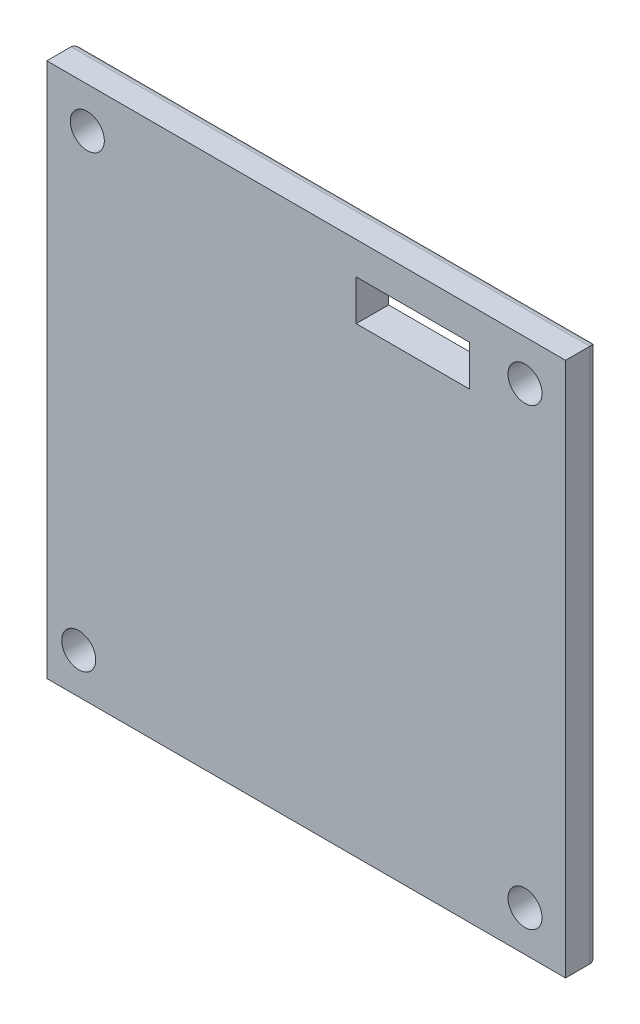
ISO-10303-21;
HEADER;
FILE_DESCRIPTION(('STEP AP214'),'2;1');
FILE_NAME('part.step','',(''),(''),'','','');
FILE_SCHEMA(('AUTOMOTIVE_DESIGN { 1 0 10303 214 1 1 1 1 }'));
ENDSEC;
DATA;
#1=APPLICATION_CONTEXT('core data for automotive mechanical design processes');
#2=APPLICATION_PROTOCOL_DEFINITION('international standard','automotive_design',2000,#1);
#3=PRODUCT_CONTEXT('',#1,'mechanical');
#4=PRODUCT('Part','Part','',(#3));
#5=PRODUCT_RELATED_PRODUCT_CATEGORY('part','',(#4));
#6=PRODUCT_DEFINITION_FORMATION('','',#4);
#7=PRODUCT_DEFINITION_CONTEXT('part definition',#1,'design');
#8=PRODUCT_DEFINITION('design','',#6,#7);
#9=PRODUCT_DEFINITION_SHAPE('','',#8);
#10=(LENGTH_UNIT() NAMED_UNIT(*) SI_UNIT(.MILLI.,.METRE.));
#11=(NAMED_UNIT(*) PLANE_ANGLE_UNIT() SI_UNIT($,.RADIAN.));
#12=(NAMED_UNIT(*) SI_UNIT($,.STERADIAN.) SOLID_ANGLE_UNIT());
#13=UNCERTAINTY_MEASURE_WITH_UNIT(LENGTH_MEASURE(1.E-05),#10,'distance_accuracy_value','');
#14=(GEOMETRIC_REPRESENTATION_CONTEXT(3) GLOBAL_UNCERTAINTY_ASSIGNED_CONTEXT((#13)) GLOBAL_UNIT_ASSIGNED_CONTEXT((#10,
#11,#12)) REPRESENTATION_CONTEXT('',''));
#15=CARTESIAN_POINT('',(0.,0.,0.));
#16=DIRECTION('',(0.,0.,1.));
#17=DIRECTION('',(1.,0.,0.));
#18=AXIS2_PLACEMENT_3D('',#15,#16,#17);
#19=CARTESIAN_POINT('',(0.,0.,-4.));
#20=DIRECTION('',(0.,0.,-1.));
#21=DIRECTION('',(-1.,0.,0.));
#22=AXIS2_PLACEMENT_3D('',#19,#20,#21);
#23=PLANE('',#22);
#24=CARTESIAN_POINT('',(0.,0.,-4.));
#25=DIRECTION('',(0.,0.,-1.));
#26=DIRECTION('',(-1.,0.,0.));
#27=AXIS2_PLACEMENT_3D('',#24,#25,#26);
#28=CIRCLE('',#27,4.);
#29=CARTESIAN_POINT('',(-4.,0.,-4.));
#30=VERTEX_POINT('',#29);
#31=EDGE_CURVE('E266',#30,#30,#28,.T.);
#32=ORIENTED_EDGE('',*,*,#31,.F.);
#33=EDGE_LOOP('',(#32));
#34=FACE_BOUND('',#33,.T.);
#35=CARTESIAN_POINT('',(-27.,28.,-4.));
#36=DIRECTION('',(0.,0.,-1.));
#37=DIRECTION('',(-1.,0.,0.));
#38=AXIS2_PLACEMENT_3D('',#35,#36,#37);
#39=CIRCLE('',#38,2.1);
#40=CARTESIAN_POINT('',(-29.1,28.,-4.));
#41=VERTEX_POINT('',#40);
#42=EDGE_CURVE('E254',#41,#41,#39,.T.);
#43=ORIENTED_EDGE('',*,*,#42,.F.);
#44=EDGE_LOOP('',(#43));
#45=FACE_BOUND('',#44,.T.);
#46=CARTESIAN_POINT('',(-28.0566288963371,-28.,-4.));
#47=DIRECTION('',(0.,0.,-1.));
#48=DIRECTION('',(-1.,0.,0.));
#49=AXIS2_PLACEMENT_3D('',#46,#47,#48);
#50=CIRCLE('',#49,2.1);
#51=CARTESIAN_POINT('',(-30.1566288963371,-28.,-4.));
#52=VERTEX_POINT('',#51);
#53=EDGE_CURVE('E258',#52,#52,#50,.T.);
#54=ORIENTED_EDGE('',*,*,#53,.F.);
#55=EDGE_LOOP('',(#54));
#56=FACE_BOUND('',#55,.T.);
#57=CARTESIAN_POINT('',(27.,-28.,-4.));
#58=DIRECTION('',(0.,0.,-1.));
#59=DIRECTION('',(-1.,0.,0.));
#60=AXIS2_PLACEMENT_3D('',#57,#58,#59);
#61=CIRCLE('',#60,2.1);
#62=CARTESIAN_POINT('',(24.9,-28.,-4.));
#63=VERTEX_POINT('',#62);
#64=EDGE_CURVE('E253',#63,#63,#61,.T.);
#65=ORIENTED_EDGE('',*,*,#64,.F.);
#66=EDGE_LOOP('',(#65));
#67=FACE_BOUND('',#66,.T.);
#68=CARTESIAN_POINT('',(27.,28.,-4.));
#69=DIRECTION('',(0.,0.,-1.));
#70=DIRECTION('',(-1.,0.,0.));
#71=AXIS2_PLACEMENT_3D('',#68,#69,#70);
#72=CIRCLE('',#71,2.1);
#73=CARTESIAN_POINT('',(24.9,28.,-4.));
#74=VERTEX_POINT('',#73);
#75=EDGE_CURVE('E236',#74,#74,#72,.T.);
#76=ORIENTED_EDGE('',*,*,#75,.F.);
#77=EDGE_LOOP('',(#76));
#78=FACE_BOUND('',#77,.T.);
#79=DIRECTION('',(0.,1.,0.));
#80=VECTOR('',#79,1.);
#81=CARTESIAN_POINT('',(6.17094740106361,29.,-4.));
#82=LINE('',#81,#80);
#83=CARTESIAN_POINT('',(6.17094740106361,24.,-4.));
#84=VERTEX_POINT('',#83);
#85=CARTESIAN_POINT('',(6.17094740106361,29.,-4.));
#86=VERTEX_POINT('',#85);
#87=EDGE_CURVE('E67',#84,#86,#82,.T.);
#88=ORIENTED_EDGE('',*,*,#87,.F.);
#89=DIRECTION('',(-1.,0.,0.));
#90=VECTOR('',#89,1.);
#91=CARTESIAN_POINT('',(20.1709474010636,24.,-4.));
#92=LINE('',#91,#90);
#93=CARTESIAN_POINT('',(20.1709474010636,24.,-4.));
#94=VERTEX_POINT('',#93);
#95=EDGE_CURVE('E140',#94,#84,#92,.T.);
#96=ORIENTED_EDGE('',*,*,#95,.F.);
#97=DIRECTION('',(0.,-1.,0.));
#98=VECTOR('',#97,1.);
#99=CARTESIAN_POINT('',(20.1709474010636,29.,-4.));
#100=LINE('',#99,#98);
#101=CARTESIAN_POINT('',(20.1709474010636,29.,-4.));
#102=VERTEX_POINT('',#101);
#103=EDGE_CURVE('E123',#102,#94,#100,.T.);
#104=ORIENTED_EDGE('',*,*,#103,.F.);
#105=DIRECTION('',(1.,0.,0.));
#106=VECTOR('',#105,1.);
#107=CARTESIAN_POINT('',(20.1709474010636,29.,-4.));
#108=LINE('',#107,#106);
#109=EDGE_CURVE('E133',#86,#102,#108,.T.);
#110=ORIENTED_EDGE('',*,*,#109,.F.);
#111=EDGE_LOOP('',(#88,#96,#104,#110));
#112=FACE_BOUND('',#111,.T.);
#113=DIRECTION('',(-1.,0.,0.));
#114=VECTOR('',#113,1.);
#115=CARTESIAN_POINT('',(-32.,-32.,-4.));
#116=LINE('',#115,#114);
#117=CARTESIAN_POINT('',(31.,-32.,-4.));
#118=VERTEX_POINT('',#117);
#119=CARTESIAN_POINT('',(-31.,-32.,-4.));
#120=VERTEX_POINT('',#119);
#121=EDGE_CURVE('E197',#118,#120,#116,.T.);
#122=ORIENTED_EDGE('',*,*,#121,.T.);
#123=DIRECTION('',(0.,1.,0.));
#124=VECTOR('',#123,1.);
#125=CARTESIAN_POINT('',(-31.,33.,-4.));
#126=LINE('',#125,#124);
#127=CARTESIAN_POINT('',(-31.,32.,-4.));
#128=VERTEX_POINT('',#127);
#129=EDGE_CURVE('E206',#120,#128,#126,.T.);
#130=ORIENTED_EDGE('',*,*,#129,.T.);
#131=DIRECTION('',(1.,0.,0.));
#132=VECTOR('',#131,1.);
#133=CARTESIAN_POINT('',(32.,32.,-4.));
#134=LINE('',#133,#132);
#135=CARTESIAN_POINT('',(31.,32.,-4.));
#136=VERTEX_POINT('',#135);
#137=EDGE_CURVE('E203',#128,#136,#134,.T.);
#138=ORIENTED_EDGE('',*,*,#137,.T.);
#139=DIRECTION('',(0.,-1.,0.));
#140=VECTOR('',#139,1.);
#141=CARTESIAN_POINT('',(31.,-33.,-4.));
#142=LINE('',#141,#140);
#143=EDGE_CURVE('E200',#136,#118,#142,.T.);
#144=ORIENTED_EDGE('',*,*,#143,.T.);
#145=EDGE_LOOP('',(#122,#130,#138,#144));
#146=FACE_BOUND('',#145,.T.);
#147=ADVANCED_FACE('F41',(#34,#45,#56,#67,#78,#112,#146),#23,.T.);
#148=CARTESIAN_POINT('',(32.,-33.,-4.));
#149=DIRECTION('',(0.,1.,0.));
#150=DIRECTION('',(0.,0.,1.));
#151=AXIS2_PLACEMENT_3D('',#148,#149,#150);
#152=PLANE('',#151);
#153=DIRECTION('',(0.,0.,1.));
#154=VECTOR('',#153,1.);
#155=CARTESIAN_POINT('',(-32.,-33.,-4.));
#156=LINE('',#155,#154);
#157=CARTESIAN_POINT('',(-32.,-33.,-3.));
#158=VERTEX_POINT('',#157);
#159=CARTESIAN_POINT('',(-32.,-33.,0.));
#160=VERTEX_POINT('',#159);
#161=EDGE_CURVE('E185',#158,#160,#156,.T.);
#162=ORIENTED_EDGE('',*,*,#161,.F.);
#163=DIRECTION('',(-1.,0.,0.));
#164=VECTOR('',#163,1.);
#165=CARTESIAN_POINT('',(32.,-33.,-3.));
#166=LINE('',#165,#164);
#167=CARTESIAN_POINT('',(32.,-33.,-3.));
#168=VERTEX_POINT('',#167);
#169=EDGE_CURVE('E11',#158,#168,#166,.F.);
#170=ORIENTED_EDGE('',*,*,#169,.T.);
#171=DIRECTION('',(0.,0.,1.));
#172=VECTOR('',#171,1.);
#173=CARTESIAN_POINT('',(32.,-33.,-4.));
#174=LINE('',#173,#172);
#175=CARTESIAN_POINT('',(32.,-33.,0.));
#176=VERTEX_POINT('',#175);
#177=EDGE_CURVE('E188',#168,#176,#174,.T.);
#178=ORIENTED_EDGE('',*,*,#177,.T.);
#179=DIRECTION('',(-1.,0.,0.));
#180=VECTOR('',#179,1.);
#181=CARTESIAN_POINT('',(32.,-33.,0.));
#182=LINE('',#181,#180);
#183=EDGE_CURVE('E181',#176,#160,#182,.T.);
#184=ORIENTED_EDGE('',*,*,#183,.T.);
#185=EDGE_LOOP('',(#162,#170,#178,#184));
#186=FACE_BOUND('',#185,.T.);
#187=ADVANCED_FACE('F285',(#186),#152,.F.);
#188=CARTESIAN_POINT('',(32.,33.,-4.));
#189=DIRECTION('',(-1.,0.,0.));
#190=DIRECTION('',(0.,-1.,0.));
#191=AXIS2_PLACEMENT_3D('',#188,#189,#190);
#192=PLANE('',#191);
#193=ORIENTED_EDGE('',*,*,#177,.F.);
#194=DIRECTION('',(0.,-1.,0.));
#195=VECTOR('',#194,1.);
#196=CARTESIAN_POINT('',(32.,33.,-3.));
#197=LINE('',#196,#195);
#198=CARTESIAN_POINT('',(32.,33.,-3.));
#199=VERTEX_POINT('',#198);
#200=EDGE_CURVE('E51',#168,#199,#197,.F.);
#201=ORIENTED_EDGE('',*,*,#200,.T.);
#202=DIRECTION('',(0.,0.,1.));
#203=VECTOR('',#202,1.);
#204=CARTESIAN_POINT('',(32.,33.,-4.));
#205=LINE('',#204,#203);
#206=CARTESIAN_POINT('',(32.,33.,0.));
#207=VERTEX_POINT('',#206);
#208=EDGE_CURVE('E191',#199,#207,#205,.T.);
#209=ORIENTED_EDGE('',*,*,#208,.T.);
#210=DIRECTION('',(0.,-1.,0.));
#211=VECTOR('',#210,1.);
#212=CARTESIAN_POINT('',(32.,33.,0.));
#213=LINE('',#212,#211);
#214=EDGE_CURVE('E177',#207,#176,#213,.T.);
#215=ORIENTED_EDGE('',*,*,#214,.T.);
#216=EDGE_LOOP('',(#193,#201,#209,#215));
#217=FACE_BOUND('',#216,.T.);
#218=ADVANCED_FACE('F321',(#217),#192,.F.);
#219=CARTESIAN_POINT('',(32.,33.,-4.));
#220=DIRECTION('',(0.,-1.,0.));
#221=DIRECTION('',(0.,0.,-1.));
#222=AXIS2_PLACEMENT_3D('',#219,#220,#221);
#223=PLANE('',#222);
#224=ORIENTED_EDGE('',*,*,#208,.F.);
#225=DIRECTION('',(1.,0.,0.));
#226=VECTOR('',#225,1.);
#227=CARTESIAN_POINT('',(-32.,33.,-3.));
#228=LINE('',#227,#226);
#229=CARTESIAN_POINT('',(-32.,33.,-3.));
#230=VERTEX_POINT('',#229);
#231=EDGE_CURVE('E214',#199,#230,#228,.F.);
#232=ORIENTED_EDGE('',*,*,#231,.T.);
#233=DIRECTION('',(0.,0.,1.));
#234=VECTOR('',#233,1.);
#235=CARTESIAN_POINT('',(-32.,33.,-4.));
#236=LINE('',#235,#234);
#237=CARTESIAN_POINT('',(-32.,33.,0.));
#238=VERTEX_POINT('',#237);
#239=EDGE_CURVE('E194',#230,#238,#236,.T.);
#240=ORIENTED_EDGE('',*,*,#239,.T.);
#241=DIRECTION('',(1.,0.,0.));
#242=VECTOR('',#241,1.);
#243=CARTESIAN_POINT('',(32.,33.,0.));
#244=LINE('',#243,#242);
#245=EDGE_CURVE('E172',#238,#207,#244,.T.);
#246=ORIENTED_EDGE('',*,*,#245,.T.);
#247=EDGE_LOOP('',(#224,#232,#240,#246));
#248=FACE_BOUND('',#247,.T.);
#249=ADVANCED_FACE('F325',(#248),#223,.F.);
#250=CARTESIAN_POINT('',(-32.,33.,-4.));
#251=DIRECTION('',(1.,0.,0.));
#252=DIRECTION('',(0.,1.,0.));
#253=AXIS2_PLACEMENT_3D('',#250,#251,#252);
#254=PLANE('',#253);
#255=ORIENTED_EDGE('',*,*,#239,.F.);
#256=DIRECTION('',(0.,1.,0.));
#257=VECTOR('',#256,1.);
#258=CARTESIAN_POINT('',(-32.,-33.,-3.));
#259=LINE('',#258,#257);
#260=EDGE_CURVE('E210',#230,#158,#259,.F.);
#261=ORIENTED_EDGE('',*,*,#260,.T.);
#262=ORIENTED_EDGE('',*,*,#161,.T.);
#263=DIRECTION('',(0.,1.,0.));
#264=VECTOR('',#263,1.);
#265=CARTESIAN_POINT('',(-32.,33.,0.));
#266=LINE('',#265,#264);
#267=EDGE_CURVE('E168',#160,#238,#266,.T.);
#268=ORIENTED_EDGE('',*,*,#267,.T.);
#269=EDGE_LOOP('',(#255,#261,#262,#268));
#270=FACE_BOUND('',#269,.T.);
#271=ADVANCED_FACE('F313',(#270),#254,.F.);
#272=CARTESIAN_POINT('',(31.,0.,-3.));
#273=DIRECTION('',(0.,1.,0.));
#274=DIRECTION('',(-1.,0.,0.));
#275=AXIS2_PLACEMENT_3D('',#272,#273,#274);
#276=CYLINDRICAL_SURFACE('',#275,1.);
#277=CARTESIAN_POINT('',(31.,32.,-3.));
#278=DIRECTION('',(-0.707106781186547,0.707106781186548,0.));
#279=DIRECTION('',(0.707106781186547,0.707106781186547,0.));
#280=AXIS2_PLACEMENT_3D('',#277,#278,#279);
#281=ELLIPSE('',#280,1.4142135623731,1.);
#282=EDGE_CURVE('E224',#199,#136,#281,.T.);
#283=ORIENTED_EDGE('',*,*,#282,.F.);
#284=ORIENTED_EDGE('',*,*,#200,.F.);
#285=CARTESIAN_POINT('',(31.,-32.,-3.));
#286=DIRECTION('',(0.707106781186547,0.707106781186547,0.));
#287=DIRECTION('',(0.707106781186547,-0.707106781186548,0.));
#288=AXIS2_PLACEMENT_3D('',#285,#286,#287);
#289=ELLIPSE('',#288,1.41421356237309,1.);
#290=EDGE_CURVE('E173',#118,#168,#289,.F.);
#291=ORIENTED_EDGE('',*,*,#290,.F.);
#292=ORIENTED_EDGE('',*,*,#143,.F.);
#293=EDGE_LOOP('',(#283,#284,#291,#292));
#294=FACE_BOUND('',#293,.T.);
#295=ADVANCED_FACE('F43',(#294),#276,.T.);
#296=CARTESIAN_POINT('',(0.,-32.,-3.));
#297=DIRECTION('',(1.,0.,0.));
#298=DIRECTION('',(0.,0.,-1.));
#299=AXIS2_PLACEMENT_3D('',#296,#297,#298);
#300=CYLINDRICAL_SURFACE('',#299,1.);
#301=ORIENTED_EDGE('',*,*,#290,.T.);
#302=ORIENTED_EDGE('',*,*,#169,.F.);
#303=CARTESIAN_POINT('',(-31.,-32.,-3.));
#304=DIRECTION('',(0.707106781186547,-0.707106781186548,0.));
#305=DIRECTION('',(0.707106781186548,0.707106781186547,0.));
#306=AXIS2_PLACEMENT_3D('',#303,#304,#305);
#307=ELLIPSE('',#306,1.4142135623731,1.);
#308=EDGE_CURVE('E221',#120,#158,#307,.F.);
#309=ORIENTED_EDGE('',*,*,#308,.F.);
#310=ORIENTED_EDGE('',*,*,#121,.F.);
#311=EDGE_LOOP('',(#301,#302,#309,#310));
#312=FACE_BOUND('',#311,.T.);
#313=ADVANCED_FACE('F337',(#312),#300,.T.);
#314=CARTESIAN_POINT('',(0.,32.,-3.));
#315=DIRECTION('',(-1.,0.,0.));
#316=DIRECTION('',(0.,0.,1.));
#317=AXIS2_PLACEMENT_3D('',#314,#315,#316);
#318=CYLINDRICAL_SURFACE('',#317,1.);
#319=ORIENTED_EDGE('',*,*,#282,.T.);
#320=ORIENTED_EDGE('',*,*,#137,.F.);
#321=CARTESIAN_POINT('',(-31.,32.,-3.));
#322=DIRECTION('',(-0.707106781186548,-0.707106781186547,0.));
#323=DIRECTION('',(-0.707106781186547,0.707106781186548,0.));
#324=AXIS2_PLACEMENT_3D('',#321,#322,#323);
#325=ELLIPSE('',#324,1.41421356237309,1.);
#326=EDGE_CURVE('E167',#230,#128,#325,.T.);
#327=ORIENTED_EDGE('',*,*,#326,.F.);
#328=ORIENTED_EDGE('',*,*,#231,.F.);
#329=EDGE_LOOP('',(#319,#320,#327,#328));
#330=FACE_BOUND('',#329,.T.);
#331=ADVANCED_FACE('F329',(#330),#318,.T.);
#332=CARTESIAN_POINT('',(-31.,0.,-3.));
#333=DIRECTION('',(0.,-1.,0.));
#334=DIRECTION('',(1.,0.,0.));
#335=AXIS2_PLACEMENT_3D('',#332,#333,#334);
#336=CYLINDRICAL_SURFACE('',#335,1.);
#337=ORIENTED_EDGE('',*,*,#308,.T.);
#338=ORIENTED_EDGE('',*,*,#260,.F.);
#339=ORIENTED_EDGE('',*,*,#326,.T.);
#340=ORIENTED_EDGE('',*,*,#129,.F.);
#341=EDGE_LOOP('',(#337,#338,#339,#340));
#342=FACE_BOUND('',#341,.T.);
#343=ADVANCED_FACE('F333',(#342),#336,.T.);
#344=CARTESIAN_POINT('',(6.17094740106361,29.,18.));
#345=DIRECTION('',(-1.,0.,0.));
#346=DIRECTION('',(0.,0.,1.));
#347=AXIS2_PLACEMENT_3D('',#344,#345,#346);
#348=PLANE('',#347);
#349=DIRECTION('',(0.,0.,-1.));
#350=VECTOR('',#349,1.);
#351=CARTESIAN_POINT('',(6.17094740106361,24.,18.));
#352=LINE('',#351,#350);
#353=CARTESIAN_POINT('',(6.17094740106361,24.,0.));
#354=VERTEX_POINT('',#353);
#355=EDGE_CURVE('E147',#354,#84,#352,.T.);
#356=ORIENTED_EDGE('',*,*,#355,.T.);
#357=ORIENTED_EDGE('',*,*,#87,.T.);
#358=DIRECTION('',(0.,0.,-1.));
#359=VECTOR('',#358,1.);
#360=CARTESIAN_POINT('',(6.17094740106361,29.,18.));
#361=LINE('',#360,#359);
#362=CARTESIAN_POINT('',(6.17094740106361,29.,0.));
#363=VERTEX_POINT('',#362);
#364=EDGE_CURVE('E130',#363,#86,#361,.T.);
#365=ORIENTED_EDGE('',*,*,#364,.F.);
#366=DIRECTION('',(0.,1.,0.));
#367=VECTOR('',#366,1.);
#368=CARTESIAN_POINT('',(6.17094740106361,0.,0.));
#369=LINE('',#368,#367);
#370=EDGE_CURVE('E163',#354,#363,#369,.T.);
#371=ORIENTED_EDGE('',*,*,#370,.F.);
#372=EDGE_LOOP('',(#356,#357,#365,#371));
#373=FACE_BOUND('',#372,.T.);
#374=ADVANCED_FACE('F355',(#373),#348,.F.);
#375=CARTESIAN_POINT('',(20.1709474010636,24.,18.));
#376=DIRECTION('',(0.,-1.,0.));
#377=DIRECTION('',(1.,0.,0.));
#378=AXIS2_PLACEMENT_3D('',#375,#376,#377);
#379=PLANE('',#378);
#380=DIRECTION('',(0.,0.,-1.));
#381=VECTOR('',#380,1.);
#382=CARTESIAN_POINT('',(20.1709474010636,24.,18.));
#383=LINE('',#382,#381);
#384=CARTESIAN_POINT('',(20.1709474010636,24.,0.));
#385=VERTEX_POINT('',#384);
#386=EDGE_CURVE('E129',#385,#94,#383,.T.);
#387=ORIENTED_EDGE('',*,*,#386,.T.);
#388=ORIENTED_EDGE('',*,*,#95,.T.);
#389=ORIENTED_EDGE('',*,*,#355,.F.);
#390=DIRECTION('',(-1.,0.,0.));
#391=VECTOR('',#390,1.);
#392=CARTESIAN_POINT('',(0.,24.,0.));
#393=LINE('',#392,#391);
#394=EDGE_CURVE('E159',#385,#354,#393,.T.);
#395=ORIENTED_EDGE('',*,*,#394,.F.);
#396=EDGE_LOOP('',(#387,#388,#389,#395));
#397=FACE_BOUND('',#396,.T.);
#398=ADVANCED_FACE('F371',(#397),#379,.F.);
#399=CARTESIAN_POINT('',(20.1709474010636,29.,18.));
#400=DIRECTION('',(1.,0.,0.));
#401=DIRECTION('',(0.,0.,-1.));
#402=AXIS2_PLACEMENT_3D('',#399,#400,#401);
#403=PLANE('',#402);
#404=DIRECTION('',(0.,0.,-1.));
#405=VECTOR('',#404,1.);
#406=CARTESIAN_POINT('',(20.1709474010636,29.,18.));
#407=LINE('',#406,#405);
#408=CARTESIAN_POINT('',(20.1709474010636,29.,0.));
#409=VERTEX_POINT('',#408);
#410=EDGE_CURVE('E59',#409,#102,#407,.T.);
#411=ORIENTED_EDGE('',*,*,#410,.T.);
#412=ORIENTED_EDGE('',*,*,#103,.T.);
#413=ORIENTED_EDGE('',*,*,#386,.F.);
#414=DIRECTION('',(0.,-1.,0.));
#415=VECTOR('',#414,1.);
#416=CARTESIAN_POINT('',(20.1709474010636,0.,0.));
#417=LINE('',#416,#415);
#418=EDGE_CURVE('E126',#409,#385,#417,.T.);
#419=ORIENTED_EDGE('',*,*,#418,.F.);
#420=EDGE_LOOP('',(#411,#412,#413,#419));
#421=FACE_BOUND('',#420,.T.);
#422=ADVANCED_FACE('F120',(#421),#403,.F.);
#423=CARTESIAN_POINT('',(20.1709474010636,29.,18.));
#424=DIRECTION('',(0.,1.,0.));
#425=DIRECTION('',(0.,0.,1.));
#426=AXIS2_PLACEMENT_3D('',#423,#424,#425);
#427=PLANE('',#426);
#428=ORIENTED_EDGE('',*,*,#364,.T.);
#429=ORIENTED_EDGE('',*,*,#109,.T.);
#430=ORIENTED_EDGE('',*,*,#410,.F.);
#431=DIRECTION('',(1.,0.,0.));
#432=VECTOR('',#431,1.);
#433=CARTESIAN_POINT('',(0.,29.,0.));
#434=LINE('',#433,#432);
#435=EDGE_CURVE('E150',#363,#409,#434,.T.);
#436=ORIENTED_EDGE('',*,*,#435,.F.);
#437=EDGE_LOOP('',(#428,#429,#430,#436));
#438=FACE_BOUND('',#437,.T.);
#439=ADVANCED_FACE('F134',(#438),#427,.F.);
#440=CARTESIAN_POINT('',(0.,0.,0.));
#441=DIRECTION('',(0.,0.,-1.));
#442=DIRECTION('',(-1.,0.,0.));
#443=AXIS2_PLACEMENT_3D('',#440,#441,#442);
#444=PLANE('',#443);
#445=CARTESIAN_POINT('',(-27.,28.,0.));
#446=DIRECTION('',(0.,0.,-1.));
#447=DIRECTION('',(-1.,0.,0.));
#448=AXIS2_PLACEMENT_3D('',#445,#446,#447);
#449=CIRCLE('',#448,2.1);
#450=CARTESIAN_POINT('',(-29.1,28.,0.));
#451=VERTEX_POINT('',#450);
#452=EDGE_CURVE('E45',#451,#451,#449,.T.);
#453=ORIENTED_EDGE('',*,*,#452,.T.);
#454=EDGE_LOOP('',(#453));
#455=FACE_BOUND('',#454,.T.);
#456=CARTESIAN_POINT('',(-28.0566288963371,-28.,0.));
#457=DIRECTION('',(0.,0.,-1.));
#458=DIRECTION('',(-1.,0.,0.));
#459=AXIS2_PLACEMENT_3D('',#456,#457,#458);
#460=CIRCLE('',#459,2.1);
#461=CARTESIAN_POINT('',(-30.1566288963371,-28.,0.));
#462=VERTEX_POINT('',#461);
#463=EDGE_CURVE('E239',#462,#462,#460,.T.);
#464=ORIENTED_EDGE('',*,*,#463,.T.);
#465=EDGE_LOOP('',(#464));
#466=FACE_BOUND('',#465,.T.);
#467=CARTESIAN_POINT('',(27.,-28.,0.));
#468=DIRECTION('',(0.,0.,-1.));
#469=DIRECTION('',(-1.,0.,0.));
#470=AXIS2_PLACEMENT_3D('',#467,#468,#469);
#471=CIRCLE('',#470,2.1);
#472=CARTESIAN_POINT('',(24.9,-28.,0.));
#473=VERTEX_POINT('',#472);
#474=EDGE_CURVE('E235',#473,#473,#471,.T.);
#475=ORIENTED_EDGE('',*,*,#474,.T.);
#476=EDGE_LOOP('',(#475));
#477=FACE_BOUND('',#476,.T.);
#478=CARTESIAN_POINT('',(27.,28.,0.));
#479=DIRECTION('',(0.,0.,-1.));
#480=DIRECTION('',(-1.,0.,0.));
#481=AXIS2_PLACEMENT_3D('',#478,#479,#480);
#482=CIRCLE('',#481,2.1);
#483=CARTESIAN_POINT('',(24.9,28.,0.));
#484=VERTEX_POINT('',#483);
#485=EDGE_CURVE('E231',#484,#484,#482,.T.);
#486=ORIENTED_EDGE('',*,*,#485,.T.);
#487=EDGE_LOOP('',(#486));
#488=FACE_BOUND('',#487,.T.);
#489=ORIENTED_EDGE('',*,*,#394,.T.);
#490=ORIENTED_EDGE('',*,*,#370,.T.);
#491=ORIENTED_EDGE('',*,*,#435,.T.);
#492=ORIENTED_EDGE('',*,*,#418,.T.);
#493=EDGE_LOOP('',(#489,#490,#491,#492));
#494=FACE_BOUND('',#493,.T.);
#495=ORIENTED_EDGE('',*,*,#267,.F.);
#496=ORIENTED_EDGE('',*,*,#183,.F.);
#497=ORIENTED_EDGE('',*,*,#214,.F.);
#498=ORIENTED_EDGE('',*,*,#245,.F.);
#499=EDGE_LOOP('',(#495,#496,#497,#498));
#500=FACE_BOUND('',#499,.T.);
#501=ADVANCED_FACE('F299',(#455,#466,#477,#488,#494,#500),#444,.F.);
#502=CARTESIAN_POINT('',(27.,28.,8.));
#503=DIRECTION('',(0.,0.,-1.));
#504=DIRECTION('',(-1.,0.,0.));
#505=AXIS2_PLACEMENT_3D('',#502,#503,#504);
#506=CYLINDRICAL_SURFACE('',#505,2.1);
#507=ORIENTED_EDGE('',*,*,#75,.T.);
#508=EDGE_LOOP('',(#507));
#509=FACE_BOUND('',#508,.T.);
#510=ORIENTED_EDGE('',*,*,#485,.F.);
#511=EDGE_LOOP('',(#510));
#512=FACE_BOUND('',#511,.T.);
#513=ADVANCED_FACE('F295',(#509,#512),#506,.F.);
#514=CARTESIAN_POINT('',(27.,-28.,8.));
#515=DIRECTION('',(0.,0.,-1.));
#516=DIRECTION('',(-1.,0.,0.));
#517=AXIS2_PLACEMENT_3D('',#514,#515,#516);
#518=CYLINDRICAL_SURFACE('',#517,2.1);
#519=ORIENTED_EDGE('',*,*,#64,.T.);
#520=EDGE_LOOP('',(#519));
#521=FACE_BOUND('',#520,.T.);
#522=ORIENTED_EDGE('',*,*,#474,.F.);
#523=EDGE_LOOP('',(#522));
#524=FACE_BOUND('',#523,.T.);
#525=ADVANCED_FACE('F298',(#521,#524),#518,.F.);
#526=CARTESIAN_POINT('',(-28.0566288963371,-28.,8.));
#527=DIRECTION('',(0.,0.,-1.));
#528=DIRECTION('',(-1.,0.,0.));
#529=AXIS2_PLACEMENT_3D('',#526,#527,#528);
#530=CYLINDRICAL_SURFACE('',#529,2.1);
#531=ORIENTED_EDGE('',*,*,#53,.T.);
#532=EDGE_LOOP('',(#531));
#533=FACE_BOUND('',#532,.T.);
#534=ORIENTED_EDGE('',*,*,#463,.F.);
#535=EDGE_LOOP('',(#534));
#536=FACE_BOUND('',#535,.T.);
#537=ADVANCED_FACE('F405',(#533,#536),#530,.F.);
#538=CARTESIAN_POINT('',(-27.,28.,8.));
#539=DIRECTION('',(0.,0.,-1.));
#540=DIRECTION('',(-1.,0.,0.));
#541=AXIS2_PLACEMENT_3D('',#538,#539,#540);
#542=CYLINDRICAL_SURFACE('',#541,2.1);
#543=ORIENTED_EDGE('',*,*,#42,.T.);
#544=EDGE_LOOP('',(#543));
#545=FACE_BOUND('',#544,.T.);
#546=ORIENTED_EDGE('',*,*,#452,.F.);
#547=EDGE_LOOP('',(#546));
#548=FACE_BOUND('',#547,.T.);
#549=ADVANCED_FACE('F279',(#545,#548),#542,.F.);
#550=CARTESIAN_POINT('',(0.,0.,-24.));
#551=DIRECTION('',(0.,0.,1.));
#552=DIRECTION('',(1.,0.,0.));
#553=AXIS2_PLACEMENT_3D('',#550,#551,#552);
#554=CYLINDRICAL_SURFACE('',#553,4.);
#555=CARTESIAN_POINT('',(0.,0.,-24.));
#556=DIRECTION('',(0.,0.,-1.));
#557=DIRECTION('',(-1.,0.,0.));
#558=AXIS2_PLACEMENT_3D('',#555,#556,#557);
#559=CIRCLE('',#558,4.);
#560=CARTESIAN_POINT('',(-4.,0.,-24.));
#561=VERTEX_POINT('',#560);
#562=EDGE_CURVE('E259',#561,#561,#559,.T.);
#563=ORIENTED_EDGE('',*,*,#562,.F.);
#564=EDGE_LOOP('',(#563));
#565=FACE_BOUND('',#564,.T.);
#566=ORIENTED_EDGE('',*,*,#31,.T.);
#567=EDGE_LOOP('',(#566));
#568=FACE_BOUND('',#567,.T.);
#569=ADVANCED_FACE('F276',(#565,#568),#554,.T.);
#570=CARTESIAN_POINT('',(0.,0.,-24.));
#571=DIRECTION('',(0.,0.,1.));
#572=DIRECTION('',(1.,0.,0.));
#573=AXIS2_PLACEMENT_3D('',#570,#571,#572);
#574=SPHERICAL_SURFACE('',#573,4.);
#575=ORIENTED_EDGE('',*,*,#562,.T.);
#576=EDGE_LOOP('',(#575));
#577=FACE_BOUND('',#576,.T.);
#578=ADVANCED_FACE('F274',(#577),#574,.T.);
#579=CLOSED_SHELL('',(#147,#187,#218,#249,#271,#295,#313,#331,#343,#374,#398,#422,#439,#501,
#513,#525,#537,#549,#569,#578));
#580=MANIFOLD_SOLID_BREP('B2',#579);
#581=ADVANCED_BREP_SHAPE_REPRESENTATION('',(#18,#580),#14);
#582=SHAPE_DEFINITION_REPRESENTATION(#9,#581);
ENDSEC;
END-ISO-10303-21;
